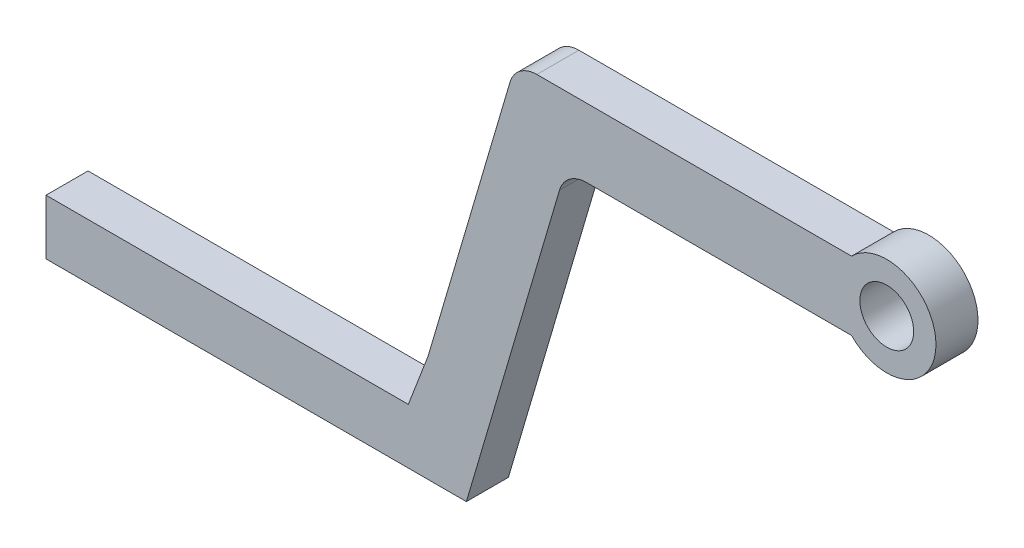
ISO-10303-21;
HEADER;
FILE_DESCRIPTION(('STEP AP214'),'2;1');
FILE_NAME('part.step','',(''),(''),'','','');
FILE_SCHEMA(('AUTOMOTIVE_DESIGN { 1 0 10303 214 1 1 1 1 }'));
ENDSEC;
DATA;
#1=APPLICATION_CONTEXT('core data for automotive mechanical design processes');
#2=APPLICATION_PROTOCOL_DEFINITION('international standard','automotive_design',2000,#1);
#3=PRODUCT_CONTEXT('',#1,'mechanical');
#4=PRODUCT('Part','Part','',(#3));
#5=PRODUCT_RELATED_PRODUCT_CATEGORY('part','',(#4));
#6=PRODUCT_DEFINITION_FORMATION('','',#4);
#7=PRODUCT_DEFINITION_CONTEXT('part definition',#1,'design');
#8=PRODUCT_DEFINITION('design','',#6,#7);
#9=PRODUCT_DEFINITION_SHAPE('','',#8);
#10=(LENGTH_UNIT() NAMED_UNIT(*) SI_UNIT(.MILLI.,.METRE.));
#11=(NAMED_UNIT(*) PLANE_ANGLE_UNIT() SI_UNIT($,.RADIAN.));
#12=(NAMED_UNIT(*) SI_UNIT($,.STERADIAN.) SOLID_ANGLE_UNIT());
#13=UNCERTAINTY_MEASURE_WITH_UNIT(LENGTH_MEASURE(1.E-05),#10,'distance_accuracy_value','');
#14=(GEOMETRIC_REPRESENTATION_CONTEXT(3) GLOBAL_UNCERTAINTY_ASSIGNED_CONTEXT((#13)) GLOBAL_UNIT_ASSIGNED_CONTEXT((#10,
#11,#12)) REPRESENTATION_CONTEXT('',''));
#15=CARTESIAN_POINT('',(0.,0.,0.));
#16=DIRECTION('',(0.,0.,1.));
#17=DIRECTION('',(1.,0.,0.));
#18=AXIS2_PLACEMENT_3D('',#15,#16,#17);
#19=CARTESIAN_POINT('',(-76.2,0.,3.81));
#20=DIRECTION('',(1.,0.,0.));
#21=DIRECTION('',(0.,0.,-1.));
#22=AXIS2_PLACEMENT_3D('',#19,#20,#21);
#23=PLANE('',#22);
#24=DIRECTION('',(0.,-1.,0.));
#25=VECTOR('',#24,1.);
#26=CARTESIAN_POINT('',(-76.2,0.,0.));
#27=LINE('',#26,#25);
#28=CARTESIAN_POINT('',(-76.2,5.00272221825071,0.));
#29=VERTEX_POINT('',#28);
#30=CARTESIAN_POINT('',(-76.2,0.,0.));
#31=VERTEX_POINT('',#30);
#32=EDGE_CURVE('E207',#29,#31,#27,.T.);
#33=ORIENTED_EDGE('',*,*,#32,.T.);
#34=DIRECTION('',(0.,0.,-1.));
#35=VECTOR('',#34,1.);
#36=CARTESIAN_POINT('',(-76.2,0.,3.81));
#37=LINE('',#36,#35);
#38=CARTESIAN_POINT('',(-76.2,0.,3.81));
#39=VERTEX_POINT('',#38);
#40=EDGE_CURVE('E165',#39,#31,#37,.T.);
#41=ORIENTED_EDGE('',*,*,#40,.F.);
#42=DIRECTION('',(0.,-1.,0.));
#43=VECTOR('',#42,1.);
#44=CARTESIAN_POINT('',(-76.2,0.,3.81));
#45=LINE('',#44,#43);
#46=CARTESIAN_POINT('',(-76.2,5.00272221825071,3.81));
#47=VERTEX_POINT('',#46);
#48=EDGE_CURVE('E151',#47,#39,#45,.T.);
#49=ORIENTED_EDGE('',*,*,#48,.F.);
#50=DIRECTION('',(0.,0.,-1.));
#51=VECTOR('',#50,1.);
#52=CARTESIAN_POINT('',(-76.2,5.00272221825071,3.81));
#53=LINE('',#52,#51);
#54=EDGE_CURVE('E152',#47,#29,#53,.T.);
#55=ORIENTED_EDGE('',*,*,#54,.T.);
#56=EDGE_LOOP('',(#33,#41,#49,#55));
#57=FACE_BOUND('',#56,.T.);
#58=ADVANCED_FACE('F33',(#57),#23,.F.);
#59=CARTESIAN_POINT('',(-38.1,0.,3.81));
#60=DIRECTION('',(0.,1.,0.));
#61=DIRECTION('',(-1.,0.,0.));
#62=AXIS2_PLACEMENT_3D('',#59,#60,#61);
#63=PLANE('',#62);
#64=DIRECTION('',(1.,0.,0.));
#65=VECTOR('',#64,1.);
#66=CARTESIAN_POINT('',(-38.1,0.,0.));
#67=LINE('',#66,#65);
#68=CARTESIAN_POINT('',(-38.1,0.,0.));
#69=VERTEX_POINT('',#68);
#70=EDGE_CURVE('E210',#31,#69,#67,.T.);
#71=ORIENTED_EDGE('',*,*,#70,.T.);
#72=DIRECTION('',(0.,0.,-1.));
#73=VECTOR('',#72,1.);
#74=CARTESIAN_POINT('',(-38.1,0.,3.81));
#75=LINE('',#74,#73);
#76=CARTESIAN_POINT('',(-38.1,0.,3.81));
#77=VERTEX_POINT('',#76);
#78=EDGE_CURVE('E162',#77,#69,#75,.T.);
#79=ORIENTED_EDGE('',*,*,#78,.F.);
#80=DIRECTION('',(1.,0.,0.));
#81=VECTOR('',#80,1.);
#82=CARTESIAN_POINT('',(-38.1,0.,3.81));
#83=LINE('',#82,#81);
#84=EDGE_CURVE('E194',#39,#77,#83,.T.);
#85=ORIENTED_EDGE('',*,*,#84,.F.);
#86=ORIENTED_EDGE('',*,*,#40,.T.);
#87=EDGE_LOOP('',(#71,#79,#85,#86));
#88=FACE_BOUND('',#87,.T.);
#89=ADVANCED_FACE('F216',(#88),#63,.F.);
#90=CARTESIAN_POINT('',(-29.121624294768,30.4952858181061,3.81));
#91=DIRECTION('',(-0.959287344532842,0.28243192209651,0.));
#92=DIRECTION('',(-0.28243192209651,-0.959287344532842,0.));
#93=AXIS2_PLACEMENT_3D('',#90,#91,#92);
#94=PLANE('',#93);
#95=DIRECTION('',(0.28243192209651,0.959287344532842,0.));
#96=VECTOR('',#95,1.);
#97=CARTESIAN_POINT('',(-29.121624294768,30.4952858181061,0.));
#98=LINE('',#97,#96);
#99=CARTESIAN_POINT('',(-29.6582381643101,28.6726629002313,0.));
#100=VERTEX_POINT('',#99);
#101=EDGE_CURVE('E144',#69,#100,#98,.T.);
#102=ORIENTED_EDGE('',*,*,#101,.T.);
#103=DIRECTION('',(0.,0.,-1.));
#104=VECTOR('',#103,1.);
#105=CARTESIAN_POINT('',(-29.6582381643101,28.6726629002313,3.81));
#106=LINE('',#105,#104);
#107=CARTESIAN_POINT('',(-29.6582381643101,28.6726629002313,3.81));
#108=VERTEX_POINT('',#107);
#109=EDGE_CURVE('E48',#100,#108,#106,.F.);
#110=ORIENTED_EDGE('',*,*,#109,.T.);
#111=DIRECTION('',(0.28243192209651,0.959287344532842,0.));
#112=VECTOR('',#111,1.);
#113=CARTESIAN_POINT('',(-29.121624294768,30.4952858181061,3.81));
#114=LINE('',#113,#112);
#115=EDGE_CURVE('E192',#77,#108,#114,.T.);
#116=ORIENTED_EDGE('',*,*,#115,.F.);
#117=ORIENTED_EDGE('',*,*,#78,.T.);
#118=EDGE_LOOP('',(#102,#110,#116,#117));
#119=FACE_BOUND('',#118,.T.);
#120=ADVANCED_FACE('F211',(#119),#94,.F.);
#121=CARTESIAN_POINT('',(0.,30.4952858181061,3.81));
#122=DIRECTION('',(0.,1.,0.));
#123=DIRECTION('',(0.,0.,1.));
#124=AXIS2_PLACEMENT_3D('',#121,#122,#123);
#125=PLANE('',#124);
#126=DIRECTION('',(1.,0.,0.));
#127=VECTOR('',#126,1.);
#128=CARTESIAN_POINT('',(0.,30.4952858181061,3.81));
#129=LINE('',#128,#127);
#130=CARTESIAN_POINT('',(-27.2216483091967,30.4952858181061,3.81));
#131=VERTEX_POINT('',#130);
#132=CARTESIAN_POINT('',(-3.19182332749766,30.4952858181061,3.81));
#133=VERTEX_POINT('',#132);
#134=EDGE_CURVE('E187',#131,#133,#129,.T.);
#135=ORIENTED_EDGE('',*,*,#134,.F.);
#136=DIRECTION('',(0.,0.,-1.));
#137=VECTOR('',#136,1.);
#138=CARTESIAN_POINT('',(-27.2216483091967,30.4952858181061,0.));
#139=LINE('',#138,#137);
#140=CARTESIAN_POINT('',(-27.2216483091967,30.4952858181061,0.));
#141=VERTEX_POINT('',#140);
#142=EDGE_CURVE('E180',#131,#141,#139,.T.);
#143=ORIENTED_EDGE('',*,*,#142,.T.);
#144=DIRECTION('',(1.,0.,0.));
#145=VECTOR('',#144,1.);
#146=CARTESIAN_POINT('',(0.,30.4952858181061,0.));
#147=LINE('',#146,#145);
#148=CARTESIAN_POINT('',(-3.19182332749766,30.4952858181061,0.));
#149=VERTEX_POINT('',#148);
#150=EDGE_CURVE('E140',#141,#149,#147,.T.);
#151=ORIENTED_EDGE('',*,*,#150,.T.);
#152=DIRECTION('',(0.,0.,1.));
#153=VECTOR('',#152,1.);
#154=CARTESIAN_POINT('',(-3.19182332749766,30.4952858181061,0.));
#155=LINE('',#154,#153);
#156=EDGE_CURVE('E124',#149,#133,#155,.T.);
#157=ORIENTED_EDGE('',*,*,#156,.T.);
#158=EDGE_LOOP('',(#135,#143,#151,#157));
#159=FACE_BOUND('',#158,.T.);
#160=ADVANCED_FACE('F186',(#159),#125,.F.);
#161=CARTESIAN_POINT('',(0.,36.7225513905723,3.81));
#162=DIRECTION('',(0.,-1.,0.));
#163=DIRECTION('',(0.,0.,-1.));
#164=AXIS2_PLACEMENT_3D('',#161,#162,#163);
#165=PLANE('',#164);
#166=DIRECTION('',(-1.,0.,0.));
#167=VECTOR('',#166,1.);
#168=CARTESIAN_POINT('',(0.,36.7225513905723,0.));
#169=LINE('',#168,#167);
#170=CARTESIAN_POINT('',(-3.19182332749766,36.7225513905723,0.));
#171=VERTEX_POINT('',#170);
#172=CARTESIAN_POINT('',(-31.7108361618127,36.7225513905723,0.));
#173=VERTEX_POINT('',#172);
#174=EDGE_CURVE('E131',#171,#173,#169,.T.);
#175=ORIENTED_EDGE('',*,*,#174,.T.);
#176=DIRECTION('',(0.,0.,-1.));
#177=VECTOR('',#176,1.);
#178=CARTESIAN_POINT('',(-31.7108361618127,36.7225513905723,3.81));
#179=LINE('',#178,#177);
#180=CARTESIAN_POINT('',(-31.7108361618127,36.7225513905723,3.81));
#181=VERTEX_POINT('',#180);
#182=EDGE_CURVE('E176',#173,#181,#179,.F.);
#183=ORIENTED_EDGE('',*,*,#182,.T.);
#184=DIRECTION('',(-1.,0.,0.));
#185=VECTOR('',#184,1.);
#186=CARTESIAN_POINT('',(0.,36.7225513905723,3.81));
#187=LINE('',#186,#185);
#188=CARTESIAN_POINT('',(-3.19182332749766,36.7225513905723,3.81));
#189=VERTEX_POINT('',#188);
#190=EDGE_CURVE('E134',#189,#181,#187,.T.);
#191=ORIENTED_EDGE('',*,*,#190,.F.);
#192=DIRECTION('',(0.,0.,1.));
#193=VECTOR('',#192,1.);
#194=CARTESIAN_POINT('',(-3.19182332749766,36.7225513905723,0.));
#195=LINE('',#194,#193);
#196=EDGE_CURVE('E121',#189,#171,#195,.F.);
#197=ORIENTED_EDGE('',*,*,#196,.T.);
#198=EDGE_LOOP('',(#175,#183,#191,#197));
#199=FACE_BOUND('',#198,.T.);
#200=ADVANCED_FACE('F130',(#199),#165,.F.);
#201=CARTESIAN_POINT('',(-33.610812147384,36.7225513905723,3.81));
#202=DIRECTION('',(0.959287344532842,-0.28243192209651,0.));
#203=DIRECTION('',(0.28243192209651,0.959287344532842,0.));
#204=AXIS2_PLACEMENT_3D('',#201,#202,#203);
#205=PLANE('',#204);
#206=DIRECTION('',(-0.28243192209651,-0.959287344532842,0.));
#207=VECTOR('',#206,1.);
#208=CARTESIAN_POINT('',(-33.610812147384,36.7225513905723,3.81));
#209=LINE('',#208,#207);
#210=CARTESIAN_POINT('',(-34.1474260169261,34.8999284726974,3.81));
#211=VERTEX_POINT('',#210);
#212=CARTESIAN_POINT('',(-41.5757494679224,9.66943531618275,3.81));
#213=VERTEX_POINT('',#212);
#214=EDGE_CURVE('E202',#211,#213,#209,.T.);
#215=ORIENTED_EDGE('',*,*,#214,.F.);
#216=DIRECTION('',(0.,0.,-1.));
#217=VECTOR('',#216,1.);
#218=CARTESIAN_POINT('',(-34.1474260169261,34.8999284726974,3.81));
#219=LINE('',#218,#217);
#220=CARTESIAN_POINT('',(-34.1474260169261,34.8999284726974,0.));
#221=VERTEX_POINT('',#220);
#222=EDGE_CURVE('E168',#211,#221,#219,.T.);
#223=ORIENTED_EDGE('',*,*,#222,.T.);
#224=DIRECTION('',(-0.28243192209651,-0.959287344532842,0.));
#225=VECTOR('',#224,1.);
#226=CARTESIAN_POINT('',(-33.610812147384,36.7225513905723,0.));
#227=LINE('',#226,#225);
#228=CARTESIAN_POINT('',(-41.5757494679224,9.66943531618275,0.));
#229=VERTEX_POINT('',#228);
#230=EDGE_CURVE('E139',#221,#229,#227,.T.);
#231=ORIENTED_EDGE('',*,*,#230,.T.);
#232=DIRECTION('',(0.,0.,-1.));
#233=VECTOR('',#232,1.);
#234=CARTESIAN_POINT('',(-41.5757494679224,9.66943531618275,3.81));
#235=LINE('',#234,#233);
#236=EDGE_CURVE('E159',#213,#229,#235,.T.);
#237=ORIENTED_EDGE('',*,*,#236,.F.);
#238=EDGE_LOOP('',(#215,#223,#231,#237));
#239=FACE_BOUND('',#238,.T.);
#240=ADVANCED_FACE('F231',(#239),#205,.F.);
#241=CARTESIAN_POINT('',(-43.3620047357626,5.00272221825071,3.81));
#242=DIRECTION('',(0.933923345188463,-0.357473335106258,0.));
#243=DIRECTION('',(0.357473335106258,0.933923345188463,0.));
#244=AXIS2_PLACEMENT_3D('',#241,#242,#243);
#245=PLANE('',#244);
#246=DIRECTION('',(-0.357473335106258,-0.933923345188463,0.));
#247=VECTOR('',#246,1.);
#248=CARTESIAN_POINT('',(-43.3620047357626,5.00272221825071,0.));
#249=LINE('',#248,#247);
#250=CARTESIAN_POINT('',(-43.3620047357626,5.00272221825071,0.));
#251=VERTEX_POINT('',#250);
#252=EDGE_CURVE('E142',#229,#251,#249,.T.);
#253=ORIENTED_EDGE('',*,*,#252,.T.);
#254=DIRECTION('',(0.,0.,-1.));
#255=VECTOR('',#254,1.);
#256=CARTESIAN_POINT('',(-43.3620047357626,5.00272221825071,3.81));
#257=LINE('',#256,#255);
#258=CARTESIAN_POINT('',(-43.3620047357626,5.00272221825071,3.81));
#259=VERTEX_POINT('',#258);
#260=EDGE_CURVE('E155',#259,#251,#257,.T.);
#261=ORIENTED_EDGE('',*,*,#260,.F.);
#262=DIRECTION('',(-0.357473335106258,-0.933923345188463,0.));
#263=VECTOR('',#262,1.);
#264=CARTESIAN_POINT('',(-43.3620047357626,5.00272221825071,3.81));
#265=LINE('',#264,#263);
#266=EDGE_CURVE('E204',#213,#259,#265,.T.);
#267=ORIENTED_EDGE('',*,*,#266,.F.);
#268=ORIENTED_EDGE('',*,*,#236,.T.);
#269=EDGE_LOOP('',(#253,#261,#267,#268));
#270=FACE_BOUND('',#269,.T.);
#271=ADVANCED_FACE('F226',(#270),#245,.F.);
#272=CARTESIAN_POINT('',(-76.2,5.00272221825071,3.81));
#273=DIRECTION('',(0.,-1.,0.));
#274=DIRECTION('',(0.,0.,-1.));
#275=AXIS2_PLACEMENT_3D('',#272,#273,#274);
#276=PLANE('',#275);
#277=DIRECTION('',(-1.,0.,0.));
#278=VECTOR('',#277,1.);
#279=CARTESIAN_POINT('',(-76.2,5.00272221825071,0.));
#280=LINE('',#279,#278);
#281=EDGE_CURVE('E149',#251,#29,#280,.T.);
#282=ORIENTED_EDGE('',*,*,#281,.T.);
#283=ORIENTED_EDGE('',*,*,#54,.F.);
#284=DIRECTION('',(-1.,0.,0.));
#285=VECTOR('',#284,1.);
#286=CARTESIAN_POINT('',(-76.2,5.00272221825071,3.81));
#287=LINE('',#286,#285);
#288=EDGE_CURVE('E156',#259,#47,#287,.T.);
#289=ORIENTED_EDGE('',*,*,#288,.F.);
#290=ORIENTED_EDGE('',*,*,#260,.T.);
#291=EDGE_LOOP('',(#282,#283,#289,#290));
#292=FACE_BOUND('',#291,.T.);
#293=ADVANCED_FACE('F222',(#292),#276,.F.);
#294=CARTESIAN_POINT('',(0.,0.,3.81));
#295=DIRECTION('',(0.,0.,-1.));
#296=DIRECTION('',(-1.,0.,0.));
#297=AXIS2_PLACEMENT_3D('',#294,#295,#296);
#298=PLANE('',#297);
#299=CARTESIAN_POINT('',(0.,33.6089186043392,3.81));
#300=DIRECTION('',(0.,0.,1.));
#301=DIRECTION('',(1.,0.,0.));
#302=AXIS2_PLACEMENT_3D('',#299,#300,#301);
#303=CIRCLE('',#302,2.43766675798766);
#304=CARTESIAN_POINT('',(2.43766675798766,33.6089186043392,3.81));
#305=VERTEX_POINT('',#304);
#306=EDGE_CURVE('E172',#305,#305,#303,.T.);
#307=ORIENTED_EDGE('',*,*,#306,.F.);
#308=EDGE_LOOP('',(#307));
#309=FACE_BOUND('',#308,.T.);
#310=ORIENTED_EDGE('',*,*,#190,.T.);
#311=CARTESIAN_POINT('',(-31.7108361618127,34.1825513905723,3.81));
#312=DIRECTION('',(0.,0.,-1.));
#313=DIRECTION('',(-1.,0.,0.));
#314=AXIS2_PLACEMENT_3D('',#311,#312,#313);
#315=CIRCLE('',#314,2.54);
#316=EDGE_CURVE('E178',#181,#211,#315,.F.);
#317=ORIENTED_EDGE('',*,*,#316,.T.);
#318=ORIENTED_EDGE('',*,*,#214,.T.);
#319=ORIENTED_EDGE('',*,*,#266,.T.);
#320=ORIENTED_EDGE('',*,*,#288,.T.);
#321=ORIENTED_EDGE('',*,*,#48,.T.);
#322=ORIENTED_EDGE('',*,*,#84,.T.);
#323=ORIENTED_EDGE('',*,*,#115,.T.);
#324=CARTESIAN_POINT('',(-27.2216483091967,27.9552858181061,3.81));
#325=DIRECTION('',(0.,0.,-1.));
#326=DIRECTION('',(-1.,0.,0.));
#327=AXIS2_PLACEMENT_3D('',#324,#325,#326);
#328=CIRCLE('',#327,2.54);
#329=EDGE_CURVE('E11',#108,#131,#328,.T.);
#330=ORIENTED_EDGE('',*,*,#329,.T.);
#331=ORIENTED_EDGE('',*,*,#134,.T.);
#332=CARTESIAN_POINT('',(0.,33.6089186043392,3.81));
#333=DIRECTION('',(0.,0.,1.));
#334=DIRECTION('',(1.,0.,0.));
#335=AXIS2_PLACEMENT_3D('',#332,#333,#334);
#336=CIRCLE('',#335,4.45897356815037);
#337=EDGE_CURVE('E126',#133,#189,#336,.T.);
#338=ORIENTED_EDGE('',*,*,#337,.T.);
#339=EDGE_LOOP('',(#310,#317,#318,#319,#320,#321,#322,#323,#330,#331,#338));
#340=FACE_BOUND('',#339,.T.);
#341=ADVANCED_FACE('F191',(#309,#340),#298,.F.);
#342=CARTESIAN_POINT('',(0.,0.,0.));
#343=DIRECTION('',(0.,0.,-1.));
#344=DIRECTION('',(-1.,0.,0.));
#345=AXIS2_PLACEMENT_3D('',#342,#343,#344);
#346=PLANE('',#345);
#347=CARTESIAN_POINT('',(0.,33.6089186043392,0.));
#348=DIRECTION('',(0.,0.,-1.));
#349=DIRECTION('',(-1.,0.,0.));
#350=AXIS2_PLACEMENT_3D('',#347,#348,#349);
#351=CIRCLE('',#350,2.43766675798766);
#352=CARTESIAN_POINT('',(-2.43766675798766,33.6089186043392,0.));
#353=VERTEX_POINT('',#352);
#354=EDGE_CURVE('E169',#353,#353,#351,.T.);
#355=ORIENTED_EDGE('',*,*,#354,.F.);
#356=EDGE_LOOP('',(#355));
#357=FACE_BOUND('',#356,.T.);
#358=ORIENTED_EDGE('',*,*,#230,.F.);
#359=CARTESIAN_POINT('',(-31.7108361618127,34.1825513905723,0.));
#360=DIRECTION('',(0.,0.,-1.));
#361=DIRECTION('',(-1.,0.,0.));
#362=AXIS2_PLACEMENT_3D('',#359,#360,#361);
#363=CIRCLE('',#362,2.54);
#364=EDGE_CURVE('E138',#221,#173,#363,.T.);
#365=ORIENTED_EDGE('',*,*,#364,.T.);
#366=ORIENTED_EDGE('',*,*,#174,.F.);
#367=CARTESIAN_POINT('',(0.,33.6089186043392,0.));
#368=DIRECTION('',(0.,0.,1.));
#369=DIRECTION('',(1.,0.,0.));
#370=AXIS2_PLACEMENT_3D('',#367,#368,#369);
#371=CIRCLE('',#370,4.45897356815037);
#372=EDGE_CURVE('E117',#149,#171,#371,.T.);
#373=ORIENTED_EDGE('',*,*,#372,.F.);
#374=ORIENTED_EDGE('',*,*,#150,.F.);
#375=CARTESIAN_POINT('',(-27.2216483091967,27.9552858181061,0.));
#376=DIRECTION('',(0.,0.,-1.));
#377=DIRECTION('',(-1.,0.,0.));
#378=AXIS2_PLACEMENT_3D('',#375,#376,#377);
#379=CIRCLE('',#378,2.54);
#380=EDGE_CURVE('E41',#141,#100,#379,.F.);
#381=ORIENTED_EDGE('',*,*,#380,.T.);
#382=ORIENTED_EDGE('',*,*,#101,.F.);
#383=ORIENTED_EDGE('',*,*,#70,.F.);
#384=ORIENTED_EDGE('',*,*,#32,.F.);
#385=ORIENTED_EDGE('',*,*,#281,.F.);
#386=ORIENTED_EDGE('',*,*,#252,.F.);
#387=EDGE_LOOP('',(#358,#365,#366,#373,#374,#381,#382,#383,#384,#385,#386));
#388=FACE_BOUND('',#387,.T.);
#389=ADVANCED_FACE('F137',(#357,#388),#346,.T.);
#390=CARTESIAN_POINT('',(0.,33.6089186043392,0.));
#391=DIRECTION('',(0.,0.,1.));
#392=DIRECTION('',(1.,0.,0.));
#393=AXIS2_PLACEMENT_3D('',#390,#391,#392);
#394=CYLINDRICAL_SURFACE('',#393,4.45897356815037);
#395=ORIENTED_EDGE('',*,*,#156,.F.);
#396=ORIENTED_EDGE('',*,*,#372,.T.);
#397=ORIENTED_EDGE('',*,*,#196,.F.);
#398=ORIENTED_EDGE('',*,*,#337,.F.);
#399=EDGE_LOOP('',(#395,#396,#397,#398));
#400=FACE_BOUND('',#399,.T.);
#401=ADVANCED_FACE('F119',(#400),#394,.T.);
#402=CARTESIAN_POINT('',(0.,33.6089186043392,-1.27));
#403=DIRECTION('',(0.,0.,1.));
#404=DIRECTION('',(1.,0.,0.));
#405=AXIS2_PLACEMENT_3D('',#402,#403,#404);
#406=CYLINDRICAL_SURFACE('',#405,2.43766675798766);
#407=ORIENTED_EDGE('',*,*,#354,.T.);
#408=EDGE_LOOP('',(#407));
#409=FACE_BOUND('',#408,.T.);
#410=ORIENTED_EDGE('',*,*,#306,.T.);
#411=EDGE_LOOP('',(#410));
#412=FACE_BOUND('',#411,.T.);
#413=ADVANCED_FACE('F242',(#409,#412),#406,.F.);
#414=CARTESIAN_POINT('',(-31.7108361618127,34.1825513905723,3.81));
#415=DIRECTION('',(0.,0.,-1.));
#416=DIRECTION('',(-1.,0.,0.));
#417=AXIS2_PLACEMENT_3D('',#414,#415,#416);
#418=CYLINDRICAL_SURFACE('',#417,2.54);
#419=ORIENTED_EDGE('',*,*,#316,.F.);
#420=ORIENTED_EDGE('',*,*,#182,.F.);
#421=ORIENTED_EDGE('',*,*,#364,.F.);
#422=ORIENTED_EDGE('',*,*,#222,.F.);
#423=EDGE_LOOP('',(#419,#420,#421,#422));
#424=FACE_BOUND('',#423,.T.);
#425=ADVANCED_FACE('F235',(#424),#418,.T.);
#426=CARTESIAN_POINT('',(-27.2216483091967,27.9552858181061,3.81));
#427=DIRECTION('',(0.,0.,1.));
#428=DIRECTION('',(1.,0.,0.));
#429=AXIS2_PLACEMENT_3D('',#426,#427,#428);
#430=CYLINDRICAL_SURFACE('',#429,2.54);
#431=ORIENTED_EDGE('',*,*,#329,.F.);
#432=ORIENTED_EDGE('',*,*,#109,.F.);
#433=ORIENTED_EDGE('',*,*,#380,.F.);
#434=ORIENTED_EDGE('',*,*,#142,.F.);
#435=EDGE_LOOP('',(#431,#432,#433,#434));
#436=FACE_BOUND('',#435,.T.);
#437=ADVANCED_FACE('F35',(#436),#430,.F.);
#438=CLOSED_SHELL('',(#58,#89,#120,#160,#200,#240,#271,#293,#341,#389,#401,#413,#425,#437));
#439=MANIFOLD_SOLID_BREP('B2',#438);
#440=ADVANCED_BREP_SHAPE_REPRESENTATION('',(#18,#439),#14);
#441=SHAPE_DEFINITION_REPRESENTATION(#9,#440);
ENDSEC;
END-ISO-10303-21;
